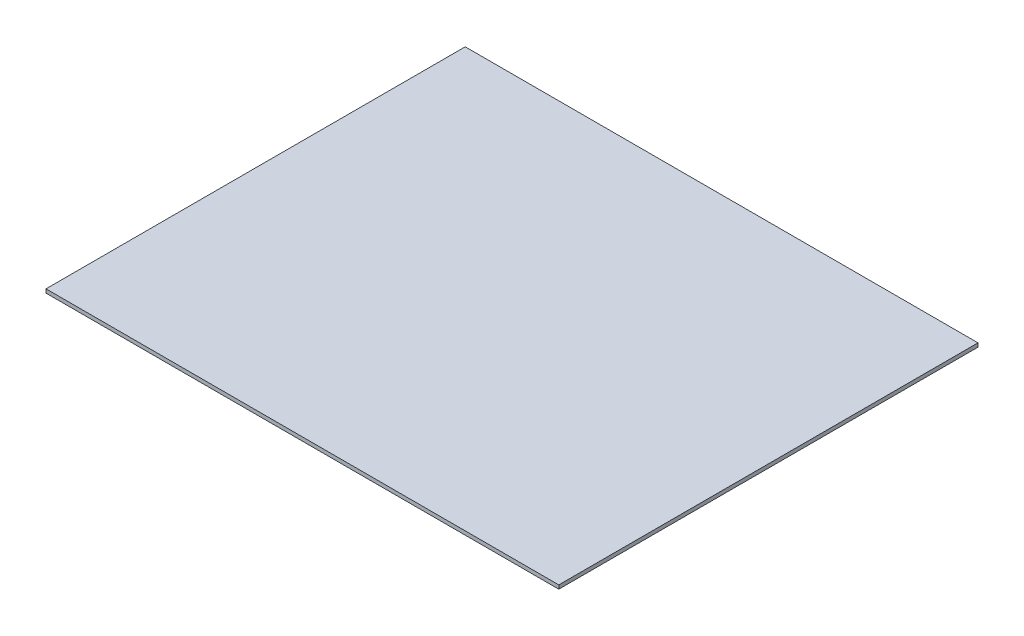
ISO-10303-21;
HEADER;
FILE_DESCRIPTION(('STEP AP214'),'2;1');
FILE_NAME('part.step','',(''),(''),'','','');
FILE_SCHEMA(('AUTOMOTIVE_DESIGN { 1 0 10303 214 1 1 1 1 }'));
ENDSEC;
DATA;
#1=APPLICATION_CONTEXT('core data for automotive mechanical design processes');
#2=APPLICATION_PROTOCOL_DEFINITION('international standard','automotive_design',2000,#1);
#3=PRODUCT_CONTEXT('',#1,'mechanical');
#4=PRODUCT('Part','Part','',(#3));
#5=PRODUCT_RELATED_PRODUCT_CATEGORY('part','',(#4));
#6=PRODUCT_DEFINITION_FORMATION('','',#4);
#7=PRODUCT_DEFINITION_CONTEXT('part definition',#1,'design');
#8=PRODUCT_DEFINITION('design','',#6,#7);
#9=PRODUCT_DEFINITION_SHAPE('','',#8);
#10=(LENGTH_UNIT() NAMED_UNIT(*) SI_UNIT(.MILLI.,.METRE.));
#11=(NAMED_UNIT(*) PLANE_ANGLE_UNIT() SI_UNIT($,.RADIAN.));
#12=(NAMED_UNIT(*) SI_UNIT($,.STERADIAN.) SOLID_ANGLE_UNIT());
#13=UNCERTAINTY_MEASURE_WITH_UNIT(LENGTH_MEASURE(1.E-05),#10,'distance_accuracy_value','');
#14=(GEOMETRIC_REPRESENTATION_CONTEXT(3) GLOBAL_UNCERTAINTY_ASSIGNED_CONTEXT((#13)) GLOBAL_UNIT_ASSIGNED_CONTEXT((#10,
#11,#12)) REPRESENTATION_CONTEXT('',''));
#15=CARTESIAN_POINT('',(0.,0.,0.));
#16=DIRECTION('',(0.,0.,1.));
#17=DIRECTION('',(1.,0.,0.));
#18=AXIS2_PLACEMENT_3D('',#15,#16,#17);
#19=CARTESIAN_POINT('',(217.4875,-3.17499999999998,177.8));
#20=DIRECTION('',(1.,0.,0.));
#21=DIRECTION('',(0.,0.,-1.));
#22=AXIS2_PLACEMENT_3D('',#19,#20,#21);
#23=PLANE('',#22);
#24=DIRECTION('',(0.,0.,-1.));
#25=VECTOR('',#24,1.);
#26=CARTESIAN_POINT('',(217.4875,0.,177.8));
#27=LINE('',#26,#25);
#28=CARTESIAN_POINT('',(217.4875,0.,177.8));
#29=VERTEX_POINT('',#28);
#30=CARTESIAN_POINT('',(217.4875,0.,-177.8));
#31=VERTEX_POINT('',#30);
#32=EDGE_CURVE('E96',#29,#31,#27,.T.);
#33=ORIENTED_EDGE('',*,*,#32,.F.);
#34=DIRECTION('',(0.,1.,0.));
#35=VECTOR('',#34,1.);
#36=CARTESIAN_POINT('',(217.4875,-3.17499999999998,177.8));
#37=LINE('',#36,#35);
#38=CARTESIAN_POINT('',(217.4875,-3.17499999999998,177.8));
#39=VERTEX_POINT('',#38);
#40=EDGE_CURVE('E11',#39,#29,#37,.T.);
#41=ORIENTED_EDGE('',*,*,#40,.F.);
#42=DIRECTION('',(0.,0.,-1.));
#43=VECTOR('',#42,1.);
#44=CARTESIAN_POINT('',(217.4875,-3.17499999999998,177.8));
#45=LINE('',#44,#43);
#46=CARTESIAN_POINT('',(217.4875,-3.17499999999998,-177.8));
#47=VERTEX_POINT('',#46);
#48=EDGE_CURVE('E90',#39,#47,#45,.T.);
#49=ORIENTED_EDGE('',*,*,#48,.T.);
#50=DIRECTION('',(0.,1.,0.));
#51=VECTOR('',#50,1.);
#52=CARTESIAN_POINT('',(217.4875,-3.17499999999998,-177.8));
#53=LINE('',#52,#51);
#54=EDGE_CURVE('E35',#47,#31,#53,.T.);
#55=ORIENTED_EDGE('',*,*,#54,.T.);
#56=EDGE_LOOP('',(#33,#41,#49,#55));
#57=FACE_BOUND('',#56,.T.);
#58=ADVANCED_FACE('F32',(#57),#23,.T.);
#59=CARTESIAN_POINT('',(-217.4875,-3.17499999999998,177.8));
#60=DIRECTION('',(0.,0.,1.));
#61=DIRECTION('',(1.,0.,0.));
#62=AXIS2_PLACEMENT_3D('',#59,#60,#61);
#63=PLANE('',#62);
#64=DIRECTION('',(1.,0.,0.));
#65=VECTOR('',#64,1.);
#66=CARTESIAN_POINT('',(-217.4875,0.,177.8));
#67=LINE('',#66,#65);
#68=CARTESIAN_POINT('',(-217.4875,0.,177.8));
#69=VERTEX_POINT('',#68);
#70=EDGE_CURVE('E92',#69,#29,#67,.T.);
#71=ORIENTED_EDGE('',*,*,#70,.F.);
#72=DIRECTION('',(0.,1.,0.));
#73=VECTOR('',#72,1.);
#74=CARTESIAN_POINT('',(-217.4875,-3.17499999999998,177.8));
#75=LINE('',#74,#73);
#76=CARTESIAN_POINT('',(-217.4875,-3.17499999999998,177.8));
#77=VERTEX_POINT('',#76);
#78=EDGE_CURVE('E41',#77,#69,#75,.T.);
#79=ORIENTED_EDGE('',*,*,#78,.F.);
#80=DIRECTION('',(1.,0.,0.));
#81=VECTOR('',#80,1.);
#82=CARTESIAN_POINT('',(-217.4875,-3.17499999999998,177.8));
#83=LINE('',#82,#81);
#84=EDGE_CURVE('E87',#77,#39,#83,.T.);
#85=ORIENTED_EDGE('',*,*,#84,.T.);
#86=ORIENTED_EDGE('',*,*,#40,.T.);
#87=EDGE_LOOP('',(#71,#79,#85,#86));
#88=FACE_BOUND('',#87,.T.);
#89=ADVANCED_FACE('F106',(#88),#63,.T.);
#90=CARTESIAN_POINT('',(-217.4875,-3.17499999999998,177.8));
#91=DIRECTION('',(-1.,0.,0.));
#92=DIRECTION('',(0.,0.,1.));
#93=AXIS2_PLACEMENT_3D('',#90,#91,#92);
#94=PLANE('',#93);
#95=DIRECTION('',(0.,0.,1.));
#96=VECTOR('',#95,1.);
#97=CARTESIAN_POINT('',(-217.4875,0.,177.8));
#98=LINE('',#97,#96);
#99=CARTESIAN_POINT('',(-217.4875,0.,-177.8));
#100=VERTEX_POINT('',#99);
#101=EDGE_CURVE('E82',#100,#69,#98,.T.);
#102=ORIENTED_EDGE('',*,*,#101,.F.);
#103=DIRECTION('',(0.,1.,0.));
#104=VECTOR('',#103,1.);
#105=CARTESIAN_POINT('',(-217.4875,-3.17499999999998,-177.8));
#106=LINE('',#105,#104);
#107=CARTESIAN_POINT('',(-217.4875,-3.17499999999998,-177.8));
#108=VERTEX_POINT('',#107);
#109=EDGE_CURVE('E77',#108,#100,#106,.T.);
#110=ORIENTED_EDGE('',*,*,#109,.F.);
#111=DIRECTION('',(0.,0.,1.));
#112=VECTOR('',#111,1.);
#113=CARTESIAN_POINT('',(-217.4875,-3.17499999999998,177.8));
#114=LINE('',#113,#112);
#115=EDGE_CURVE('E80',#108,#77,#114,.T.);
#116=ORIENTED_EDGE('',*,*,#115,.T.);
#117=ORIENTED_EDGE('',*,*,#78,.T.);
#118=EDGE_LOOP('',(#102,#110,#116,#117));
#119=FACE_BOUND('',#118,.T.);
#120=ADVANCED_FACE('F79',(#119),#94,.T.);
#121=CARTESIAN_POINT('',(-217.4875,-3.17499999999998,-177.8));
#122=DIRECTION('',(0.,0.,-1.));
#123=DIRECTION('',(-1.,0.,0.));
#124=AXIS2_PLACEMENT_3D('',#121,#122,#123);
#125=PLANE('',#124);
#126=DIRECTION('',(-1.,0.,0.));
#127=VECTOR('',#126,1.);
#128=CARTESIAN_POINT('',(-217.4875,0.,-177.8));
#129=LINE('',#128,#127);
#130=EDGE_CURVE('E99',#31,#100,#129,.T.);
#131=ORIENTED_EDGE('',*,*,#130,.F.);
#132=ORIENTED_EDGE('',*,*,#54,.F.);
#133=DIRECTION('',(-1.,0.,0.));
#134=VECTOR('',#133,1.);
#135=CARTESIAN_POINT('',(-217.4875,-3.17499999999998,-177.8));
#136=LINE('',#135,#134);
#137=EDGE_CURVE('E86',#47,#108,#136,.T.);
#138=ORIENTED_EDGE('',*,*,#137,.T.);
#139=ORIENTED_EDGE('',*,*,#109,.T.);
#140=EDGE_LOOP('',(#131,#132,#138,#139));
#141=FACE_BOUND('',#140,.T.);
#142=ADVANCED_FACE('F89',(#141),#125,.T.);
#143=CARTESIAN_POINT('',(0.,-3.17499999999998,0.));
#144=DIRECTION('',(0.,-1.,0.));
#145=DIRECTION('',(0.,0.,-1.));
#146=AXIS2_PLACEMENT_3D('',#143,#144,#145);
#147=PLANE('',#146);
#148=ORIENTED_EDGE('',*,*,#48,.F.);
#149=ORIENTED_EDGE('',*,*,#84,.F.);
#150=ORIENTED_EDGE('',*,*,#115,.F.);
#151=ORIENTED_EDGE('',*,*,#137,.F.);
#152=EDGE_LOOP('',(#148,#149,#150,#151));
#153=FACE_BOUND('',#152,.T.);
#154=ADVANCED_FACE('F85',(#153),#147,.T.);
#155=CARTESIAN_POINT('',(0.,0.,0.));
#156=DIRECTION('',(0.,-1.,0.));
#157=DIRECTION('',(0.,0.,-1.));
#158=AXIS2_PLACEMENT_3D('',#155,#156,#157);
#159=PLANE('',#158);
#160=ORIENTED_EDGE('',*,*,#32,.T.);
#161=ORIENTED_EDGE('',*,*,#130,.T.);
#162=ORIENTED_EDGE('',*,*,#101,.T.);
#163=ORIENTED_EDGE('',*,*,#70,.T.);
#164=EDGE_LOOP('',(#160,#161,#162,#163));
#165=FACE_BOUND('',#164,.T.);
#166=ADVANCED_FACE('F105',(#165),#159,.F.);
#167=CLOSED_SHELL('',(#58,#89,#120,#142,#154,#166));
#168=MANIFOLD_SOLID_BREP('B2',#167);
#169=ADVANCED_BREP_SHAPE_REPRESENTATION('',(#18,#168),#14);
#170=SHAPE_DEFINITION_REPRESENTATION(#9,#169);
ENDSEC;
END-ISO-10303-21;
